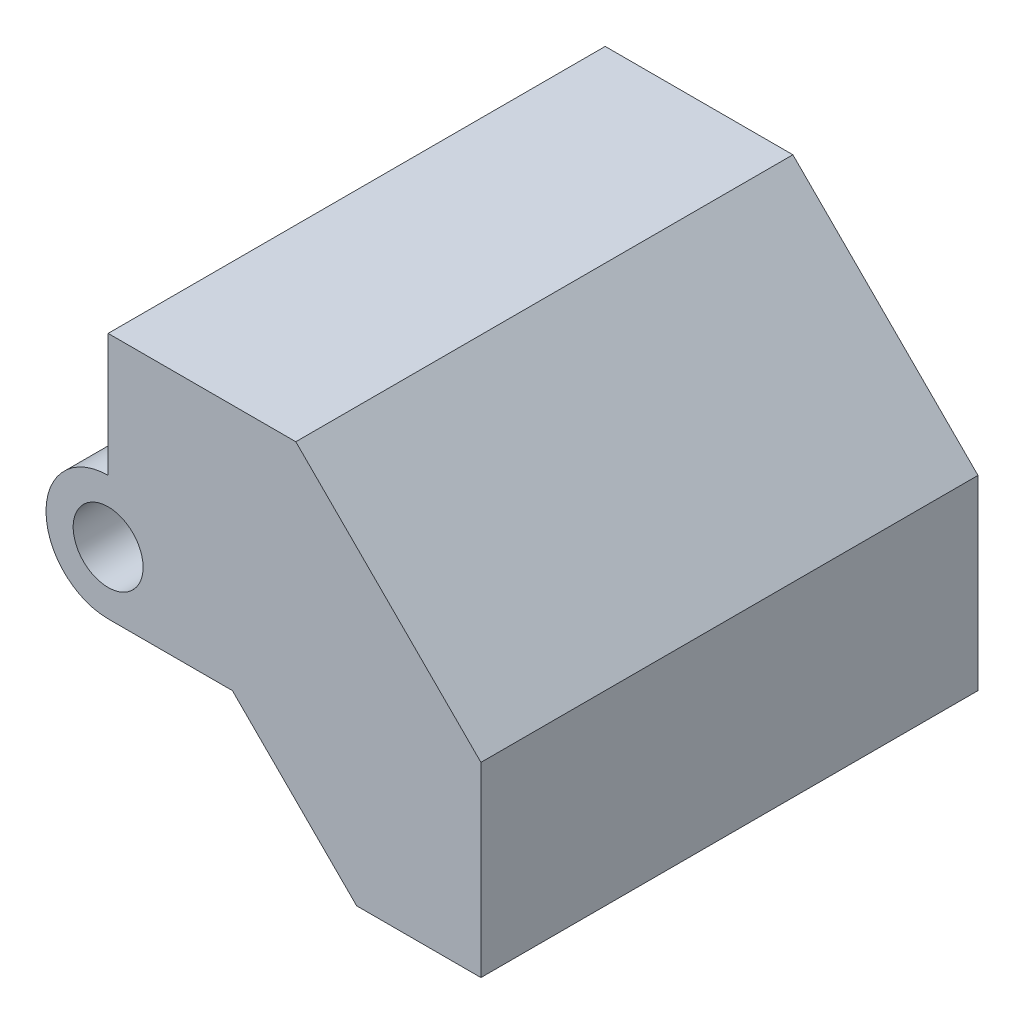
ISO-10303-21;
HEADER;
FILE_DESCRIPTION(('STEP AP214'),'2;1');
FILE_NAME('part.step','',(''),(''),'','','');
FILE_SCHEMA(('AUTOMOTIVE_DESIGN { 1 0 10303 214 1 1 1 1 }'));
ENDSEC;
DATA;
#1=APPLICATION_CONTEXT('core data for automotive mechanical design processes');
#2=APPLICATION_PROTOCOL_DEFINITION('international standard','automotive_design',2000,#1);
#3=PRODUCT_CONTEXT('',#1,'mechanical');
#4=PRODUCT('Part','Part','',(#3));
#5=PRODUCT_RELATED_PRODUCT_CATEGORY('part','',(#4));
#6=PRODUCT_DEFINITION_FORMATION('','',#4);
#7=PRODUCT_DEFINITION_CONTEXT('part definition',#1,'design');
#8=PRODUCT_DEFINITION('design','',#6,#7);
#9=PRODUCT_DEFINITION_SHAPE('','',#8);
#10=(LENGTH_UNIT() NAMED_UNIT(*) SI_UNIT(.MILLI.,.METRE.));
#11=(NAMED_UNIT(*) PLANE_ANGLE_UNIT() SI_UNIT($,.RADIAN.));
#12=(NAMED_UNIT(*) SI_UNIT($,.STERADIAN.) SOLID_ANGLE_UNIT());
#13=UNCERTAINTY_MEASURE_WITH_UNIT(LENGTH_MEASURE(1.E-05),#10,'distance_accuracy_value','');
#14=(GEOMETRIC_REPRESENTATION_CONTEXT(3) GLOBAL_UNCERTAINTY_ASSIGNED_CONTEXT((#13)) GLOBAL_UNIT_ASSIGNED_CONTEXT((#10,
#11,#12)) REPRESENTATION_CONTEXT('',''));
#15=CARTESIAN_POINT('',(0.,0.,0.));
#16=DIRECTION('',(0.,0.,1.));
#17=DIRECTION('',(1.,0.,0.));
#18=AXIS2_PLACEMENT_3D('',#15,#16,#17);
#19=CARTESIAN_POINT('',(-6.27303093052545,0.,-50.8));
#20=DIRECTION('',(-1.,0.,0.));
#21=DIRECTION('',(0.,0.,1.));
#22=AXIS2_PLACEMENT_3D('',#19,#20,#21);
#23=PLANE('',#22);
#24=DIRECTION('',(0.,-1.,0.));
#25=VECTOR('',#24,1.);
#26=CARTESIAN_POINT('',(-6.27303093052545,0.,0.));
#27=LINE('',#26,#25);
#28=CARTESIAN_POINT('',(-6.27303093052545,24.7816802506899,0.));
#29=VERTEX_POINT('',#28);
#30=CARTESIAN_POINT('',(-6.27303093052545,12.2128627233243,0.));
#31=VERTEX_POINT('',#30);
#32=EDGE_CURVE('E144',#29,#31,#27,.T.);
#33=ORIENTED_EDGE('',*,*,#32,.F.);
#34=DIRECTION('',(0.,0.,1.));
#35=VECTOR('',#34,1.);
#36=CARTESIAN_POINT('',(-6.27303093052545,24.7816802506899,-50.8));
#37=LINE('',#36,#35);
#38=CARTESIAN_POINT('',(-6.27303093052545,24.7816802506899,-50.8));
#39=VERTEX_POINT('',#38);
#40=EDGE_CURVE('E11',#39,#29,#37,.T.);
#41=ORIENTED_EDGE('',*,*,#40,.F.);
#42=DIRECTION('',(0.,-1.,0.));
#43=VECTOR('',#42,1.);
#44=CARTESIAN_POINT('',(-6.27303093052545,0.,-50.8));
#45=LINE('',#44,#43);
#46=CARTESIAN_POINT('',(-6.27303093052545,12.2128627233243,-50.8));
#47=VERTEX_POINT('',#46);
#48=EDGE_CURVE('E173',#39,#47,#45,.T.);
#49=ORIENTED_EDGE('',*,*,#48,.T.);
#50=DIRECTION('',(0.,0.,1.));
#51=VECTOR('',#50,1.);
#52=CARTESIAN_POINT('',(-6.27303093052545,12.2128627233243,-50.8));
#53=LINE('',#52,#51);
#54=EDGE_CURVE('E44',#47,#31,#53,.T.);
#55=ORIENTED_EDGE('',*,*,#54,.T.);
#56=EDGE_LOOP('',(#33,#41,#49,#55));
#57=FACE_BOUND('',#56,.T.);
#58=ADVANCED_FACE('F41',(#57),#23,.T.);
#59=CARTESIAN_POINT('',(0.,24.7816802506899,-50.8));
#60=DIRECTION('',(0.,1.,0.));
#61=DIRECTION('',(0.,0.,1.));
#62=AXIS2_PLACEMENT_3D('',#59,#60,#61);
#63=PLANE('',#62);
#64=DIRECTION('',(-1.,0.,0.));
#65=VECTOR('',#64,1.);
#66=CARTESIAN_POINT('',(0.,24.7816802506899,0.));
#67=LINE('',#66,#65);
#68=CARTESIAN_POINT('',(12.9081515421089,24.7816802506899,0.));
#69=VERTEX_POINT('',#68);
#70=EDGE_CURVE('E170',#69,#29,#67,.T.);
#71=ORIENTED_EDGE('',*,*,#70,.F.);
#72=DIRECTION('',(0.,0.,1.));
#73=VECTOR('',#72,1.);
#74=CARTESIAN_POINT('',(12.9081515421089,24.7816802506899,-50.8));
#75=LINE('',#74,#73);
#76=CARTESIAN_POINT('',(12.9081515421089,24.7816802506899,-50.8));
#77=VERTEX_POINT('',#76);
#78=EDGE_CURVE('E51',#77,#69,#75,.T.);
#79=ORIENTED_EDGE('',*,*,#78,.F.);
#80=DIRECTION('',(-1.,0.,0.));
#81=VECTOR('',#80,1.);
#82=CARTESIAN_POINT('',(0.,24.7816802506899,-50.8));
#83=LINE('',#82,#81);
#84=EDGE_CURVE('E130',#77,#39,#83,.T.);
#85=ORIENTED_EDGE('',*,*,#84,.T.);
#86=ORIENTED_EDGE('',*,*,#40,.T.);
#87=EDGE_LOOP('',(#71,#79,#85,#86));
#88=FACE_BOUND('',#87,.T.);
#89=ADVANCED_FACE('F191',(#88),#63,.T.);
#90=CARTESIAN_POINT('',(18.8449158963994,18.8449158963994,-50.8));
#91=DIRECTION('',(0.707106781186548,0.707106781186548,0.));
#92=DIRECTION('',(-0.707106781186548,0.707106781186548,0.));
#93=AXIS2_PLACEMENT_3D('',#90,#91,#92);
#94=PLANE('',#93);
#95=DIRECTION('',(-0.707106781186548,0.707106781186548,0.));
#96=VECTOR('',#95,1.);
#97=CARTESIAN_POINT('',(18.8449158963994,18.8449158963994,0.));
#98=LINE('',#97,#96);
#99=CARTESIAN_POINT('',(31.8269690694745,5.86286272332426,0.));
#100=VERTEX_POINT('',#99);
#101=EDGE_CURVE('E116',#100,#69,#98,.T.);
#102=ORIENTED_EDGE('',*,*,#101,.F.);
#103=DIRECTION('',(0.,0.,1.));
#104=VECTOR('',#103,1.);
#105=CARTESIAN_POINT('',(31.8269690694745,5.86286272332426,-50.8));
#106=LINE('',#105,#104);
#107=CARTESIAN_POINT('',(31.8269690694745,5.86286272332426,-50.8));
#108=VERTEX_POINT('',#107);
#109=EDGE_CURVE('E111',#108,#100,#106,.T.);
#110=ORIENTED_EDGE('',*,*,#109,.F.);
#111=DIRECTION('',(-0.707106781186548,0.707106781186548,0.));
#112=VECTOR('',#111,1.);
#113=CARTESIAN_POINT('',(18.8449158963994,18.8449158963994,-50.8));
#114=LINE('',#113,#112);
#115=EDGE_CURVE('E114',#108,#77,#114,.T.);
#116=ORIENTED_EDGE('',*,*,#115,.T.);
#117=ORIENTED_EDGE('',*,*,#78,.T.);
#118=EDGE_LOOP('',(#102,#110,#116,#117));
#119=FACE_BOUND('',#118,.T.);
#120=ADVANCED_FACE('F113',(#119),#94,.T.);
#121=CARTESIAN_POINT('',(31.8269690694745,0.,-50.8));
#122=DIRECTION('',(1.,0.,0.));
#123=DIRECTION('',(0.,0.,-1.));
#124=AXIS2_PLACEMENT_3D('',#121,#122,#123);
#125=PLANE('',#124);
#126=DIRECTION('',(0.,1.,0.));
#127=VECTOR('',#126,1.);
#128=CARTESIAN_POINT('',(31.8269690694745,0.,0.));
#129=LINE('',#128,#127);
#130=CARTESIAN_POINT('',(31.8269690694745,-13.1871372766757,0.));
#131=VERTEX_POINT('',#130);
#132=EDGE_CURVE('E165',#131,#100,#129,.T.);
#133=ORIENTED_EDGE('',*,*,#132,.F.);
#134=DIRECTION('',(0.,0.,1.));
#135=VECTOR('',#134,1.);
#136=CARTESIAN_POINT('',(31.8269690694745,-13.1871372766757,-50.8));
#137=LINE('',#136,#135);
#138=CARTESIAN_POINT('',(31.8269690694745,-13.1871372766757,-50.8));
#139=VERTEX_POINT('',#138);
#140=EDGE_CURVE('E122',#139,#131,#137,.T.);
#141=ORIENTED_EDGE('',*,*,#140,.F.);
#142=DIRECTION('',(0.,1.,0.));
#143=VECTOR('',#142,1.);
#144=CARTESIAN_POINT('',(31.8269690694745,0.,-50.8));
#145=LINE('',#144,#143);
#146=EDGE_CURVE('E128',#139,#108,#145,.T.);
#147=ORIENTED_EDGE('',*,*,#146,.T.);
#148=ORIENTED_EDGE('',*,*,#109,.T.);
#149=EDGE_LOOP('',(#133,#141,#147,#148));
#150=FACE_BOUND('',#149,.T.);
#151=ADVANCED_FACE('F133',(#150),#125,.T.);
#152=CARTESIAN_POINT('',(0.,-13.1871372766757,-50.8));
#153=DIRECTION('',(0.,-1.,0.));
#154=DIRECTION('',(0.,0.,-1.));
#155=AXIS2_PLACEMENT_3D('',#152,#153,#154);
#156=PLANE('',#155);
#157=DIRECTION('',(1.,0.,0.));
#158=VECTOR('',#157,1.);
#159=CARTESIAN_POINT('',(0.,-13.1871372766757,0.));
#160=LINE('',#159,#158);
#161=CARTESIAN_POINT('',(19.1269690694745,-13.1871372766757,0.));
#162=VERTEX_POINT('',#161);
#163=EDGE_CURVE('E161',#162,#131,#160,.T.);
#164=ORIENTED_EDGE('',*,*,#163,.F.);
#165=DIRECTION('',(0.,0.,1.));
#166=VECTOR('',#165,1.);
#167=CARTESIAN_POINT('',(19.1269690694745,-13.1871372766757,-50.8));
#168=LINE('',#167,#166);
#169=CARTESIAN_POINT('',(19.1269690694745,-13.1871372766757,-50.8));
#170=VERTEX_POINT('',#169);
#171=EDGE_CURVE('E179',#170,#162,#168,.T.);
#172=ORIENTED_EDGE('',*,*,#171,.F.);
#173=DIRECTION('',(1.,0.,0.));
#174=VECTOR('',#173,1.);
#175=CARTESIAN_POINT('',(0.,-13.1871372766757,-50.8));
#176=LINE('',#175,#174);
#177=EDGE_CURVE('E135',#170,#139,#176,.T.);
#178=ORIENTED_EDGE('',*,*,#177,.T.);
#179=ORIENTED_EDGE('',*,*,#140,.T.);
#180=EDGE_LOOP('',(#164,#172,#178,#179));
#181=FACE_BOUND('',#180,.T.);
#182=ADVANCED_FACE('F204',(#181),#156,.T.);
#183=CARTESIAN_POINT('',(2.9699158963994,2.9699158963994,-50.8));
#184=DIRECTION('',(-0.707106781186547,-0.707106781186548,0.));
#185=DIRECTION('',(0.707106781186548,-0.707106781186547,0.));
#186=AXIS2_PLACEMENT_3D('',#183,#184,#185);
#187=PLANE('',#186);
#188=DIRECTION('',(0.707106781186548,-0.707106781186547,0.));
#189=VECTOR('',#188,1.);
#190=CARTESIAN_POINT('',(2.9699158963994,2.9699158963994,0.));
#191=LINE('',#190,#189);
#192=CARTESIAN_POINT('',(6.42696906947455,-0.48713727667574,0.));
#193=VERTEX_POINT('',#192);
#194=EDGE_CURVE('E157',#193,#162,#191,.T.);
#195=ORIENTED_EDGE('',*,*,#194,.F.);
#196=DIRECTION('',(0.,0.,1.));
#197=VECTOR('',#196,1.);
#198=CARTESIAN_POINT('',(6.42696906947455,-0.48713727667574,-50.8));
#199=LINE('',#198,#197);
#200=CARTESIAN_POINT('',(6.42696906947455,-0.48713727667574,-50.8));
#201=VERTEX_POINT('',#200);
#202=EDGE_CURVE('E182',#201,#193,#199,.T.);
#203=ORIENTED_EDGE('',*,*,#202,.F.);
#204=DIRECTION('',(0.707106781186548,-0.707106781186547,0.));
#205=VECTOR('',#204,1.);
#206=CARTESIAN_POINT('',(2.9699158963994,2.9699158963994,-50.8));
#207=LINE('',#206,#205);
#208=EDGE_CURVE('E138',#201,#170,#207,.T.);
#209=ORIENTED_EDGE('',*,*,#208,.T.);
#210=ORIENTED_EDGE('',*,*,#171,.T.);
#211=EDGE_LOOP('',(#195,#203,#209,#210));
#212=FACE_BOUND('',#211,.T.);
#213=ADVANCED_FACE('F207',(#212),#187,.T.);
#214=CARTESIAN_POINT('',(0.,-0.48713727667574,-50.8));
#215=DIRECTION('',(0.,-1.,0.));
#216=DIRECTION('',(0.,0.,-1.));
#217=AXIS2_PLACEMENT_3D('',#214,#215,#216);
#218=PLANE('',#217);
#219=DIRECTION('',(1.,0.,0.));
#220=VECTOR('',#219,1.);
#221=CARTESIAN_POINT('',(0.,-0.48713727667574,0.));
#222=LINE('',#221,#220);
#223=CARTESIAN_POINT('',(-6.27303093052545,-0.48713727667574,0.));
#224=VERTEX_POINT('',#223);
#225=EDGE_CURVE('E153',#224,#193,#222,.T.);
#226=ORIENTED_EDGE('',*,*,#225,.F.);
#227=DIRECTION('',(0.,0.,1.));
#228=VECTOR('',#227,1.);
#229=CARTESIAN_POINT('',(-6.27303093052545,-0.48713727667574,-50.8));
#230=LINE('',#229,#228);
#231=CARTESIAN_POINT('',(-6.27303093052545,-0.48713727667574,-50.8));
#232=VERTEX_POINT('',#231);
#233=EDGE_CURVE('E184',#232,#224,#230,.T.);
#234=ORIENTED_EDGE('',*,*,#233,.F.);
#235=DIRECTION('',(1.,0.,0.));
#236=VECTOR('',#235,1.);
#237=CARTESIAN_POINT('',(0.,-0.48713727667574,-50.8));
#238=LINE('',#237,#236);
#239=EDGE_CURVE('E246',#232,#201,#238,.T.);
#240=ORIENTED_EDGE('',*,*,#239,.T.);
#241=ORIENTED_EDGE('',*,*,#202,.T.);
#242=EDGE_LOOP('',(#226,#234,#240,#241));
#243=FACE_BOUND('',#242,.T.);
#244=ADVANCED_FACE('F211',(#243),#218,.T.);
#245=CARTESIAN_POINT('',(-6.27303093052545,5.86286272332426,-50.8));
#246=DIRECTION('',(0.,0.,1.));
#247=DIRECTION('',(1.,0.,0.));
#248=AXIS2_PLACEMENT_3D('',#245,#246,#247);
#249=CYLINDRICAL_SURFACE('',#248,6.35);
#250=CARTESIAN_POINT('',(-6.27303093052545,5.86286272332426,0.));
#251=DIRECTION('',(0.,0.,1.));
#252=DIRECTION('',(1.,0.,0.));
#253=AXIS2_PLACEMENT_3D('',#250,#251,#252);
#254=CIRCLE('',#253,6.35);
#255=EDGE_CURVE('E148',#31,#224,#254,.T.);
#256=ORIENTED_EDGE('',*,*,#255,.F.);
#257=ORIENTED_EDGE('',*,*,#54,.F.);
#258=CARTESIAN_POINT('',(-6.27303093052545,5.86286272332426,-50.8));
#259=DIRECTION('',(0.,0.,1.));
#260=DIRECTION('',(1.,0.,0.));
#261=AXIS2_PLACEMENT_3D('',#258,#259,#260);
#262=CIRCLE('',#261,6.35);
#263=EDGE_CURVE('E243',#47,#232,#262,.T.);
#264=ORIENTED_EDGE('',*,*,#263,.T.);
#265=ORIENTED_EDGE('',*,*,#233,.T.);
#266=EDGE_LOOP('',(#256,#257,#264,#265));
#267=FACE_BOUND('',#266,.T.);
#268=ADVANCED_FACE('F188',(#267),#249,.T.);
#269=CARTESIAN_POINT('',(0.,0.,-50.8));
#270=DIRECTION('',(0.,0.,1.));
#271=DIRECTION('',(1.,0.,0.));
#272=AXIS2_PLACEMENT_3D('',#269,#270,#271);
#273=PLANE('',#272);
#274=CARTESIAN_POINT('',(-6.27303093052545,5.86286272332426,-50.8));
#275=DIRECTION('',(0.,0.,1.));
#276=DIRECTION('',(1.,0.,0.));
#277=AXIS2_PLACEMENT_3D('',#274,#275,#276);
#278=CIRCLE('',#277,3.57187499999999);
#279=CARTESIAN_POINT('',(-2.70115593052546,5.86286272332426,-50.8));
#280=VERTEX_POINT('',#279);
#281=EDGE_CURVE('E149',#280,#280,#278,.T.);
#282=ORIENTED_EDGE('',*,*,#281,.T.);
#283=EDGE_LOOP('',(#282));
#284=FACE_BOUND('',#283,.T.);
#285=ORIENTED_EDGE('',*,*,#48,.F.);
#286=ORIENTED_EDGE('',*,*,#84,.F.);
#287=ORIENTED_EDGE('',*,*,#115,.F.);
#288=ORIENTED_EDGE('',*,*,#146,.F.);
#289=ORIENTED_EDGE('',*,*,#177,.F.);
#290=ORIENTED_EDGE('',*,*,#208,.F.);
#291=ORIENTED_EDGE('',*,*,#239,.F.);
#292=ORIENTED_EDGE('',*,*,#263,.F.);
#293=EDGE_LOOP('',(#285,#286,#287,#288,#289,#290,#291,#292));
#294=FACE_BOUND('',#293,.T.);
#295=ADVANCED_FACE('F126',(#284,#294),#273,.F.);
#296=CARTESIAN_POINT('',(0.,0.,0.));
#297=DIRECTION('',(0.,0.,1.));
#298=DIRECTION('',(1.,0.,0.));
#299=AXIS2_PLACEMENT_3D('',#296,#297,#298);
#300=PLANE('',#299);
#301=CARTESIAN_POINT('',(-6.27303093052545,5.86286272332426,0.));
#302=DIRECTION('',(0.,0.,1.));
#303=DIRECTION('',(1.,0.,0.));
#304=AXIS2_PLACEMENT_3D('',#301,#302,#303);
#305=CIRCLE('',#304,3.57187499999999);
#306=CARTESIAN_POINT('',(-2.70115593052546,5.86286272332426,0.));
#307=VERTEX_POINT('',#306);
#308=EDGE_CURVE('E235',#307,#307,#305,.T.);
#309=ORIENTED_EDGE('',*,*,#308,.F.);
#310=EDGE_LOOP('',(#309));
#311=FACE_BOUND('',#310,.T.);
#312=ORIENTED_EDGE('',*,*,#32,.T.);
#313=ORIENTED_EDGE('',*,*,#255,.T.);
#314=ORIENTED_EDGE('',*,*,#225,.T.);
#315=ORIENTED_EDGE('',*,*,#194,.T.);
#316=ORIENTED_EDGE('',*,*,#163,.T.);
#317=ORIENTED_EDGE('',*,*,#132,.T.);
#318=ORIENTED_EDGE('',*,*,#101,.T.);
#319=ORIENTED_EDGE('',*,*,#70,.T.);
#320=EDGE_LOOP('',(#312,#313,#314,#315,#316,#317,#318,#319));
#321=FACE_BOUND('',#320,.T.);
#322=ADVANCED_FACE('F190',(#311,#321),#300,.T.);
#323=CARTESIAN_POINT('',(-6.27303093052545,5.86286272332426,0.));
#324=DIRECTION('',(0.,0.,1.));
#325=DIRECTION('',(1.,0.,0.));
#326=AXIS2_PLACEMENT_3D('',#323,#324,#325);
#327=CYLINDRICAL_SURFACE('',#326,3.57187499999999);
#328=ORIENTED_EDGE('',*,*,#281,.F.);
#329=EDGE_LOOP('',(#328));
#330=FACE_BOUND('',#329,.T.);
#331=ORIENTED_EDGE('',*,*,#308,.T.);
#332=EDGE_LOOP('',(#331));
#333=FACE_BOUND('',#332,.T.);
#334=ADVANCED_FACE('F223',(#330,#333),#327,.F.);
#335=CLOSED_SHELL('',(#58,#89,#120,#151,#182,#213,#244,#268,#295,#322,#334));
#336=MANIFOLD_SOLID_BREP('B2',#335);
#337=ADVANCED_BREP_SHAPE_REPRESENTATION('',(#18,#336),#14);
#338=SHAPE_DEFINITION_REPRESENTATION(#9,#337);
ENDSEC;
END-ISO-10303-21;
